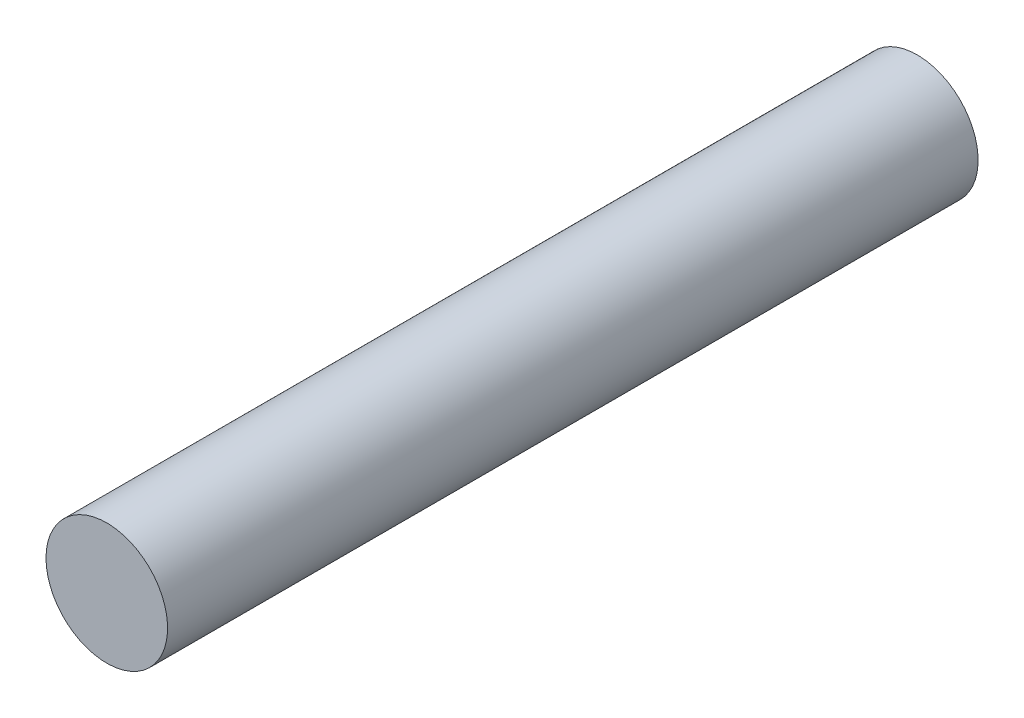
ISO-10303-21;
HEADER;
FILE_DESCRIPTION(('STEP AP214'),'2;1');
FILE_NAME('part.step','',(''),(''),'','','');
FILE_SCHEMA(('AUTOMOTIVE_DESIGN { 1 0 10303 214 1 1 1 1 }'));
ENDSEC;
DATA;
#1=APPLICATION_CONTEXT('core data for automotive mechanical design processes');
#2=APPLICATION_PROTOCOL_DEFINITION('international standard','automotive_design',2000,#1);
#3=PRODUCT_CONTEXT('',#1,'mechanical');
#4=PRODUCT('Part','Part','',(#3));
#5=PRODUCT_RELATED_PRODUCT_CATEGORY('part','',(#4));
#6=PRODUCT_DEFINITION_FORMATION('','',#4);
#7=PRODUCT_DEFINITION_CONTEXT('part definition',#1,'design');
#8=PRODUCT_DEFINITION('design','',#6,#7);
#9=PRODUCT_DEFINITION_SHAPE('','',#8);
#10=(LENGTH_UNIT() NAMED_UNIT(*) SI_UNIT(.MILLI.,.METRE.));
#11=(NAMED_UNIT(*) PLANE_ANGLE_UNIT() SI_UNIT($,.RADIAN.));
#12=(NAMED_UNIT(*) SI_UNIT($,.STERADIAN.) SOLID_ANGLE_UNIT());
#13=UNCERTAINTY_MEASURE_WITH_UNIT(LENGTH_MEASURE(1.E-05),#10,'distance_accuracy_value','');
#14=(GEOMETRIC_REPRESENTATION_CONTEXT(3) GLOBAL_UNCERTAINTY_ASSIGNED_CONTEXT((#13)) GLOBAL_UNIT_ASSIGNED_CONTEXT((#10,
#11,#12)) REPRESENTATION_CONTEXT('',''));
#15=CARTESIAN_POINT('',(0.,0.,0.));
#16=DIRECTION('',(0.,0.,1.));
#17=DIRECTION('',(1.,0.,0.));
#18=AXIS2_PLACEMENT_3D('',#15,#16,#17);
#19=CARTESIAN_POINT('',(-0.455450907590688,0.,2.));
#20=DIRECTION('',(0.,0.,1.));
#21=DIRECTION('',(1.,0.,0.));
#22=AXIS2_PLACEMENT_3D('',#19,#20,#21);
#23=PLANE('',#22);
#24=CARTESIAN_POINT('',(-0.455450907590688,0.,2.));
#25=DIRECTION('',(0.,0.,-1.));
#26=DIRECTION('',(-1.,0.,0.));
#27=AXIS2_PLACEMENT_3D('',#24,#25,#26);
#28=CIRCLE('',#27,0.75);
#29=CARTESIAN_POINT('',(-1.20545090759069,0.,2.));
#30=VERTEX_POINT('',#29);
#31=EDGE_CURVE('E17',#30,#30,#28,.T.);
#32=ORIENTED_EDGE('',*,*,#31,.F.);
#33=EDGE_LOOP('',(#32));
#34=FACE_BOUND('',#33,.T.);
#35=ADVANCED_FACE('F14',(#34),#23,.T.);
#36=CARTESIAN_POINT('',(-0.455450907590688,0.,-8.));
#37=DIRECTION('',(0.,0.,1.));
#38=DIRECTION('',(1.,0.,0.));
#39=AXIS2_PLACEMENT_3D('',#36,#37,#38);
#40=PLANE('',#39);
#41=CARTESIAN_POINT('',(-0.455450907590688,0.,-8.));
#42=DIRECTION('',(0.,0.,-1.));
#43=DIRECTION('',(-1.,0.,0.));
#44=AXIS2_PLACEMENT_3D('',#41,#42,#43);
#45=CIRCLE('',#44,0.75);
#46=CARTESIAN_POINT('',(-1.20545090759069,0.,-8.));
#47=VERTEX_POINT('',#46);
#48=EDGE_CURVE('E10',#47,#47,#45,.F.);
#49=ORIENTED_EDGE('',*,*,#48,.F.);
#50=EDGE_LOOP('',(#49));
#51=FACE_BOUND('',#50,.T.);
#52=ADVANCED_FACE('F29',(#51),#40,.F.);
#53=CARTESIAN_POINT('',(-0.455450907590688,0.,2.));
#54=DIRECTION('',(0.,0.,-1.));
#55=DIRECTION('',(-1.,0.,0.));
#56=AXIS2_PLACEMENT_3D('',#53,#54,#55);
#57=CYLINDRICAL_SURFACE('',#56,0.75);
#58=ORIENTED_EDGE('',*,*,#48,.T.);
#59=EDGE_LOOP('',(#58));
#60=FACE_BOUND('',#59,.T.);
#61=ORIENTED_EDGE('',*,*,#31,.T.);
#62=EDGE_LOOP('',(#61));
#63=FACE_BOUND('',#62,.T.);
#64=ADVANCED_FACE('F26',(#60,#63),#57,.T.);
#65=CLOSED_SHELL('',(#35,#52,#64));
#66=MANIFOLD_SOLID_BREP('B1',#65);
#67=ADVANCED_BREP_SHAPE_REPRESENTATION('',(#18,#66),#14);
#68=SHAPE_DEFINITION_REPRESENTATION(#9,#67);
ENDSEC;
END-ISO-10303-21;
